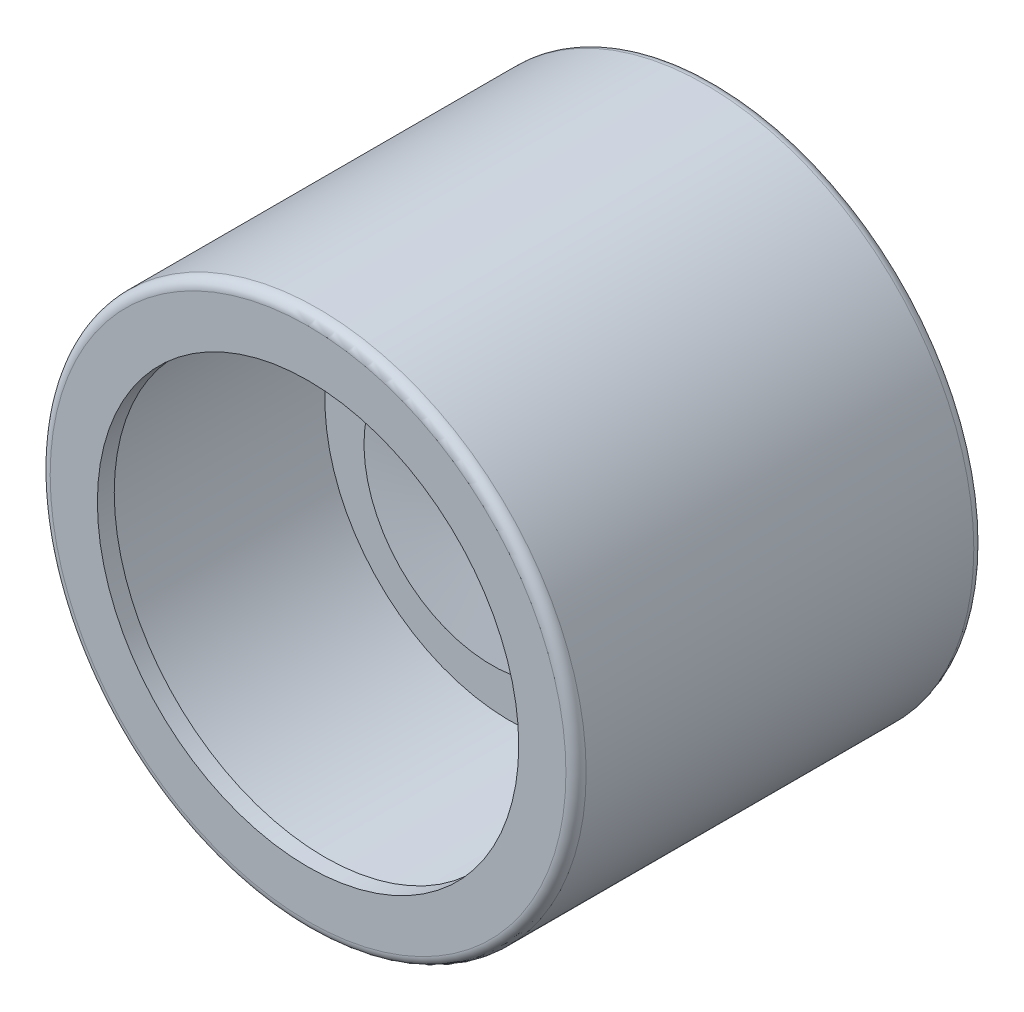
ISO-10303-21;
HEADER;
FILE_DESCRIPTION(('STEP AP214'),'2;1');
FILE_NAME('part.step','',(''),(''),'','','');
FILE_SCHEMA(('AUTOMOTIVE_DESIGN { 1 0 10303 214 1 1 1 1 }'));
ENDSEC;
DATA;
#1=APPLICATION_CONTEXT('core data for automotive mechanical design processes');
#2=APPLICATION_PROTOCOL_DEFINITION('international standard','automotive_design',2000,#1);
#3=PRODUCT_CONTEXT('',#1,'mechanical');
#4=PRODUCT('Part','Part','',(#3));
#5=PRODUCT_RELATED_PRODUCT_CATEGORY('part','',(#4));
#6=PRODUCT_DEFINITION_FORMATION('','',#4);
#7=PRODUCT_DEFINITION_CONTEXT('part definition',#1,'design');
#8=PRODUCT_DEFINITION('design','',#6,#7);
#9=PRODUCT_DEFINITION_SHAPE('','',#8);
#10=(LENGTH_UNIT() NAMED_UNIT(*) SI_UNIT(.MILLI.,.METRE.));
#11=(NAMED_UNIT(*) PLANE_ANGLE_UNIT() SI_UNIT($,.RADIAN.));
#12=(NAMED_UNIT(*) SI_UNIT($,.STERADIAN.) SOLID_ANGLE_UNIT());
#13=UNCERTAINTY_MEASURE_WITH_UNIT(LENGTH_MEASURE(1.E-05),#10,'distance_accuracy_value','');
#14=(GEOMETRIC_REPRESENTATION_CONTEXT(3) GLOBAL_UNCERTAINTY_ASSIGNED_CONTEXT((#13)) GLOBAL_UNIT_ASSIGNED_CONTEXT((#10,
#11,#12)) REPRESENTATION_CONTEXT('',''));
#15=CARTESIAN_POINT('',(0.,0.,0.));
#16=DIRECTION('',(0.,0.,1.));
#17=DIRECTION('',(1.,0.,0.));
#18=AXIS2_PLACEMENT_3D('',#15,#16,#17);
#19=CARTESIAN_POINT('',(0.,0.,6.1));
#20=DIRECTION('',(0.,0.,1.));
#21=DIRECTION('',(1.,0.,0.));
#22=AXIS2_PLACEMENT_3D('',#19,#20,#21);
#23=PLANE('',#22);
#24=CARTESIAN_POINT('',(0.,0.,6.1));
#25=DIRECTION('',(0.,0.,1.));
#26=DIRECTION('',(1.,0.,0.));
#27=AXIS2_PLACEMENT_3D('',#24,#25,#26);
#28=CIRCLE('',#27,5.5);
#29=CARTESIAN_POINT('',(5.5,0.,6.1));
#30=VERTEX_POINT('',#29);
#31=EDGE_CURVE('E74',#30,#30,#28,.T.);
#32=ORIENTED_EDGE('',*,*,#31,.T.);
#33=EDGE_LOOP('',(#32));
#34=FACE_BOUND('',#33,.T.);
#35=CARTESIAN_POINT('',(0.,0.,6.1));
#36=DIRECTION('',(0.,0.,1.));
#37=DIRECTION('',(1.,0.,0.));
#38=AXIS2_PLACEMENT_3D('',#35,#36,#37);
#39=CIRCLE('',#38,3.7909010050328);
#40=CARTESIAN_POINT('',(3.7909010050328,0.,6.1));
#41=VERTEX_POINT('',#40);
#42=EDGE_CURVE('E11',#41,#41,#39,.T.);
#43=ORIENTED_EDGE('',*,*,#42,.F.);
#44=EDGE_LOOP('',(#43));
#45=FACE_BOUND('',#44,.T.);
#46=ADVANCED_FACE('F38',(#34,#45),#23,.T.);
#47=CARTESIAN_POINT('',(0.,0.,12.1));
#48=DIRECTION('',(0.,0.,-1.));
#49=DIRECTION('',(-1.,0.,0.));
#50=AXIS2_PLACEMENT_3D('',#47,#48,#49);
#51=CYLINDRICAL_SURFACE('',#50,7.95);
#52=CARTESIAN_POINT('',(0.,0.,0.3));
#53=DIRECTION('',(0.,0.,1.));
#54=DIRECTION('',(1.,0.,0.));
#55=AXIS2_PLACEMENT_3D('',#52,#53,#54);
#56=CIRCLE('',#55,7.95);
#57=CARTESIAN_POINT('',(7.95,0.,0.3));
#58=VERTEX_POINT('',#57);
#59=EDGE_CURVE('E61',#58,#58,#56,.T.);
#60=ORIENTED_EDGE('',*,*,#59,.T.);
#61=EDGE_LOOP('',(#60));
#62=FACE_BOUND('',#61,.T.);
#63=CARTESIAN_POINT('',(0.,0.,11.8));
#64=DIRECTION('',(0.,0.,1.));
#65=DIRECTION('',(1.,0.,0.));
#66=AXIS2_PLACEMENT_3D('',#63,#64,#65);
#67=CIRCLE('',#66,7.95);
#68=CARTESIAN_POINT('',(7.95,0.,11.8));
#69=VERTEX_POINT('',#68);
#70=EDGE_CURVE('E64',#69,#69,#67,.F.);
#71=ORIENTED_EDGE('',*,*,#70,.T.);
#72=EDGE_LOOP('',(#71));
#73=FACE_BOUND('',#72,.T.);
#74=ADVANCED_FACE('F108',(#62,#73),#51,.T.);
#75=CARTESIAN_POINT('',(0.,0.,12.1));
#76=DIRECTION('',(0.,0.,1.));
#77=DIRECTION('',(1.,0.,0.));
#78=AXIS2_PLACEMENT_3D('',#75,#76,#77);
#79=PLANE('',#78);
#80=CARTESIAN_POINT('',(0.,0.,12.1));
#81=DIRECTION('',(0.,0.,1.));
#82=DIRECTION('',(1.,0.,0.));
#83=AXIS2_PLACEMENT_3D('',#80,#81,#82);
#84=CIRCLE('',#83,7.65);
#85=CARTESIAN_POINT('',(7.65,0.,12.1));
#86=VERTEX_POINT('',#85);
#87=EDGE_CURVE('E53',#86,#86,#84,.T.);
#88=ORIENTED_EDGE('',*,*,#87,.T.);
#89=EDGE_LOOP('',(#88));
#90=FACE_BOUND('',#89,.T.);
#91=CARTESIAN_POINT('',(0.,0.,12.1));
#92=DIRECTION('',(0.,0.,1.));
#93=DIRECTION('',(1.,0.,0.));
#94=AXIS2_PLACEMENT_3D('',#91,#92,#93);
#95=CIRCLE('',#94,6.25);
#96=CARTESIAN_POINT('',(6.25,0.,12.1));
#97=VERTEX_POINT('',#96);
#98=EDGE_CURVE('E71',#97,#97,#95,.T.);
#99=ORIENTED_EDGE('',*,*,#98,.F.);
#100=EDGE_LOOP('',(#99));
#101=FACE_BOUND('',#100,.T.);
#102=ADVANCED_FACE('F113',(#90,#101),#79,.T.);
#103=CARTESIAN_POINT('',(0.,0.,0.));
#104=DIRECTION('',(0.,0.,1.));
#105=DIRECTION('',(1.,0.,0.));
#106=AXIS2_PLACEMENT_3D('',#103,#104,#105);
#107=PLANE('',#106);
#108=CARTESIAN_POINT('',(0.,0.,0.));
#109=DIRECTION('',(0.,0.,1.));
#110=DIRECTION('',(1.,0.,0.));
#111=AXIS2_PLACEMENT_3D('',#108,#109,#110);
#112=CIRCLE('',#111,7.65);
#113=CARTESIAN_POINT('',(7.65,0.,0.));
#114=VERTEX_POINT('',#113);
#115=EDGE_CURVE('E58',#114,#114,#112,.F.);
#116=ORIENTED_EDGE('',*,*,#115,.T.);
#117=EDGE_LOOP('',(#116));
#118=FACE_BOUND('',#117,.T.);
#119=ADVANCED_FACE('F143',(#118),#107,.F.);
#120=CARTESIAN_POINT('',(0.,0.,0.3));
#121=DIRECTION('',(0.,0.,1.));
#122=DIRECTION('',(1.,0.,0.));
#123=AXIS2_PLACEMENT_3D('',#120,#121,#122);
#124=TOROIDAL_SURFACE('',#123,7.65,0.3);
#125=ORIENTED_EDGE('',*,*,#115,.F.);
#126=EDGE_LOOP('',(#125));
#127=FACE_BOUND('',#126,.T.);
#128=ORIENTED_EDGE('',*,*,#59,.F.);
#129=EDGE_LOOP('',(#128));
#130=FACE_BOUND('',#129,.T.);
#131=ADVANCED_FACE('F146',(#127,#130),#124,.T.);
#132=CARTESIAN_POINT('',(0.,0.,11.8));
#133=DIRECTION('',(0.,0.,1.));
#134=DIRECTION('',(1.,0.,0.));
#135=AXIS2_PLACEMENT_3D('',#132,#133,#134);
#136=TOROIDAL_SURFACE('',#135,7.65,0.3);
#137=ORIENTED_EDGE('',*,*,#70,.F.);
#138=EDGE_LOOP('',(#137));
#139=FACE_BOUND('',#138,.T.);
#140=ORIENTED_EDGE('',*,*,#87,.F.);
#141=EDGE_LOOP('',(#140));
#142=FACE_BOUND('',#141,.T.);
#143=ADVANCED_FACE('F40',(#139,#142),#136,.T.);
#144=CARTESIAN_POINT('',(0.,0.,11.6));
#145=DIRECTION('',(0.,0.,1.));
#146=DIRECTION('',(1.,0.,0.));
#147=AXIS2_PLACEMENT_3D('',#144,#145,#146);
#148=PLANE('',#147);
#149=CARTESIAN_POINT('',(0.,0.,11.6));
#150=DIRECTION('',(0.,0.,1.));
#151=DIRECTION('',(1.,0.,0.));
#152=AXIS2_PLACEMENT_3D('',#149,#150,#151);
#153=CIRCLE('',#152,6.25);
#154=CARTESIAN_POINT('',(6.25,0.,11.6));
#155=VERTEX_POINT('',#154);
#156=EDGE_CURVE('E70',#155,#155,#153,.T.);
#157=ORIENTED_EDGE('',*,*,#156,.T.);
#158=EDGE_LOOP('',(#157));
#159=FACE_BOUND('',#158,.T.);
#160=CARTESIAN_POINT('',(0.,0.,11.6));
#161=DIRECTION('',(0.,0.,1.));
#162=DIRECTION('',(1.,0.,0.));
#163=AXIS2_PLACEMENT_3D('',#160,#161,#162);
#164=CIRCLE('',#163,7.5);
#165=CARTESIAN_POINT('',(7.5,0.,11.6));
#166=VERTEX_POINT('',#165);
#167=EDGE_CURVE('E49',#166,#166,#164,.F.);
#168=ORIENTED_EDGE('',*,*,#167,.T.);
#169=EDGE_LOOP('',(#168));
#170=FACE_BOUND('',#169,.T.);
#171=ADVANCED_FACE('F130',(#159,#170),#148,.F.);
#172=CARTESIAN_POINT('',(0.,0.,11.6));
#173=DIRECTION('',(0.,0.,1.));
#174=DIRECTION('',(1.,0.,0.));
#175=AXIS2_PLACEMENT_3D('',#172,#173,#174);
#176=CYLINDRICAL_SURFACE('',#175,6.25);
#177=ORIENTED_EDGE('',*,*,#156,.F.);
#178=EDGE_LOOP('',(#177));
#179=FACE_BOUND('',#178,.T.);
#180=ORIENTED_EDGE('',*,*,#98,.T.);
#181=EDGE_LOOP('',(#180));
#182=FACE_BOUND('',#181,.T.);
#183=ADVANCED_FACE('F126',(#179,#182),#176,.F.);
#184=CARTESIAN_POINT('',(0.,0.,2.1));
#185=DIRECTION('',(0.,0.,1.));
#186=DIRECTION('',(1.,0.,0.));
#187=AXIS2_PLACEMENT_3D('',#184,#185,#186);
#188=PLANE('',#187);
#189=CARTESIAN_POINT('',(0.,0.,2.1));
#190=DIRECTION('',(0.,0.,1.));
#191=DIRECTION('',(1.,0.,0.));
#192=AXIS2_PLACEMENT_3D('',#189,#190,#191);
#193=CIRCLE('',#192,5.5);
#194=CARTESIAN_POINT('',(5.5,0.,2.1));
#195=VERTEX_POINT('',#194);
#196=EDGE_CURVE('E77',#195,#195,#193,.T.);
#197=ORIENTED_EDGE('',*,*,#196,.F.);
#198=EDGE_LOOP('',(#197));
#199=FACE_BOUND('',#198,.T.);
#200=CARTESIAN_POINT('',(0.,0.,2.1));
#201=DIRECTION('',(0.,0.,1.));
#202=DIRECTION('',(1.,0.,0.));
#203=AXIS2_PLACEMENT_3D('',#200,#201,#202);
#204=CIRCLE('',#203,7.5);
#205=CARTESIAN_POINT('',(7.5,0.,2.1));
#206=VERTEX_POINT('',#205);
#207=EDGE_CURVE('E67',#206,#206,#204,.T.);
#208=ORIENTED_EDGE('',*,*,#207,.T.);
#209=EDGE_LOOP('',(#208));
#210=FACE_BOUND('',#209,.T.);
#211=ADVANCED_FACE('F129',(#199,#210),#188,.T.);
#212=CARTESIAN_POINT('',(0.,0.,2.1));
#213=DIRECTION('',(0.,0.,1.));
#214=DIRECTION('',(1.,0.,0.));
#215=AXIS2_PLACEMENT_3D('',#212,#213,#214);
#216=CYLINDRICAL_SURFACE('',#215,7.5);
#217=ORIENTED_EDGE('',*,*,#207,.F.);
#218=EDGE_LOOP('',(#217));
#219=FACE_BOUND('',#218,.T.);
#220=ORIENTED_EDGE('',*,*,#167,.F.);
#221=EDGE_LOOP('',(#220));
#222=FACE_BOUND('',#221,.T.);
#223=ADVANCED_FACE('F124',(#219,#222),#216,.F.);
#224=CARTESIAN_POINT('',(0.,0.,6.1));
#225=DIRECTION('',(0.,0.,-1.));
#226=DIRECTION('',(-1.,0.,0.));
#227=AXIS2_PLACEMENT_3D('',#224,#225,#226);
#228=CYLINDRICAL_SURFACE('',#227,5.5);
#229=ORIENTED_EDGE('',*,*,#31,.F.);
#230=EDGE_LOOP('',(#229));
#231=FACE_BOUND('',#230,.T.);
#232=ORIENTED_EDGE('',*,*,#196,.T.);
#233=EDGE_LOOP('',(#232));
#234=FACE_BOUND('',#233,.T.);
#235=ADVANCED_FACE('F121',(#231,#234),#228,.T.);
#236=CARTESIAN_POINT('',(0.,0.,0.));
#237=DIRECTION('',(0.,0.,-1.));
#238=DIRECTION('',(0.,1.,0.));
#239=AXIS2_PLACEMENT_3D('',#236,#237,#238);
#240=CYLINDRICAL_SURFACE('',#239,3.7909010050328);
#241=ORIENTED_EDGE('',*,*,#42,.T.);
#242=EDGE_LOOP('',(#241));
#243=FACE_BOUND('',#242,.T.);
#244=CARTESIAN_POINT('',(0.,0.,6.65));
#245=DIRECTION('',(0.,0.,-1.));
#246=DIRECTION('',(0.,1.,0.));
#247=AXIS2_PLACEMENT_3D('',#244,#245,#246);
#248=CIRCLE('',#247,3.7909010050328);
#249=CARTESIAN_POINT('',(0.,3.7909010050328,6.65));
#250=VERTEX_POINT('',#249);
#251=EDGE_CURVE('E80',#250,#250,#248,.T.);
#252=ORIENTED_EDGE('',*,*,#251,.T.);
#253=EDGE_LOOP('',(#252));
#254=FACE_BOUND('',#253,.T.);
#255=ADVANCED_FACE('F119',(#243,#254),#240,.T.);
#256=CARTESIAN_POINT('',(0.,0.,6.65));
#257=DIRECTION('',(0.,0.,1.));
#258=DIRECTION('',(0.,-1.,0.));
#259=AXIS2_PLACEMENT_3D('',#256,#257,#258);
#260=CONICAL_SURFACE('',#259,3.7909010050328,1.45108807305091);
#261=CARTESIAN_POINT('',(0.,0.,6.31884257165239));
#262=DIRECTION('',(0.,0.,-1.));
#263=DIRECTION('',(0.,1.,0.));
#264=AXIS2_PLACEMENT_3D('',#261,#262,#263);
#265=CIRCLE('',#264,1.03775684955081);
#266=CARTESIAN_POINT('',(0.,1.03775684955081,6.31884257165239));
#267=VERTEX_POINT('',#266);
#268=EDGE_CURVE('E85',#267,#267,#265,.T.);
#269=ORIENTED_EDGE('',*,*,#268,.T.);
#270=EDGE_LOOP('',(#269));
#271=FACE_BOUND('',#270,.T.);
#272=ORIENTED_EDGE('',*,*,#251,.F.);
#273=EDGE_LOOP('',(#272));
#274=FACE_BOUND('',#273,.T.);
#275=ADVANCED_FACE('F105',(#271,#274),#260,.F.);
#276=CARTESIAN_POINT('',(0.,0.,4.82957729286775));
#277=DIRECTION('',(0.,0.,-1.));
#278=DIRECTION('',(0.,1.,0.));
#279=AXIS2_PLACEMENT_3D('',#276,#277,#278);
#280=DEGENERATE_TOROIDAL_SURFACE('',#279,1.21689068054462,1.5,.T.);
#281=CARTESIAN_POINT('',(0.,0.,6.1194532886291));
#282=DIRECTION('',(0.,0.,-1.));
#283=DIRECTION('',(0.,1.,0.));
#284=AXIS2_PLACEMENT_3D('',#281,#282,#283);
#285=CIRCLE('',#284,0.451240685077581);
#286=CARTESIAN_POINT('',(0.,0.45124068507758,6.1194532886291));
#287=VERTEX_POINT('',#286);
#288=EDGE_CURVE('E88',#287,#287,#285,.T.);
#289=ORIENTED_EDGE('',*,*,#288,.T.);
#290=EDGE_LOOP('',(#289));
#291=FACE_BOUND('',#290,.T.);
#292=ORIENTED_EDGE('',*,*,#268,.F.);
#293=EDGE_LOOP('',(#292));
#294=FACE_BOUND('',#293,.T.);
#295=ADVANCED_FACE('F92',(#291,#294),#280,.T.);
#296=CARTESIAN_POINT('',(0.,0.,6.1194532886291));
#297=DIRECTION('',(0.,0.,1.));
#298=DIRECTION('',(0.,-1.,0.));
#299=AXIS2_PLACEMENT_3D('',#296,#297,#298);
#300=CONICAL_SURFACE('',#299,0.451240685077581,1.0351076909461);
#301=CARTESIAN_POINT('',(0.,0.,6.1));
#302=DIRECTION('',(0.,0.,1.));
#303=DIRECTION('',(1.,0.,0.));
#304=AXIS2_PLACEMENT_3D('',#301,#302,#303);
#305=CIRCLE('',#304,0.418468099444649);
#306=CARTESIAN_POINT('',(0.418468099444649,0.,6.1));
#307=VERTEX_POINT('',#306);
#308=EDGE_CURVE('E45',#307,#307,#305,.F.);
#309=ORIENTED_EDGE('',*,*,#308,.T.);
#310=EDGE_LOOP('',(#309));
#311=FACE_BOUND('',#310,.T.);
#312=ORIENTED_EDGE('',*,*,#288,.F.);
#313=EDGE_LOOP('',(#312));
#314=FACE_BOUND('',#313,.T.);
#315=ADVANCED_FACE('F95',(#311,#314),#300,.F.);
#316=ORIENTED_EDGE('',*,*,#308,.F.);
#317=EDGE_LOOP('',(#316));
#318=FACE_BOUND('',#317,.T.);
#319=ADVANCED_FACE('F97',(#318),#23,.T.);
#320=CLOSED_SHELL('',(#46,#74,#102,#119,#131,#143,#171,#183,#211,#223,#235,#255,#275,#295,#315,#319));
#321=MANIFOLD_SOLID_BREP('B2',#320);
#322=ADVANCED_BREP_SHAPE_REPRESENTATION('',(#18,#321),#14);
#323=SHAPE_DEFINITION_REPRESENTATION(#9,#322);
ENDSEC;
END-ISO-10303-21;
